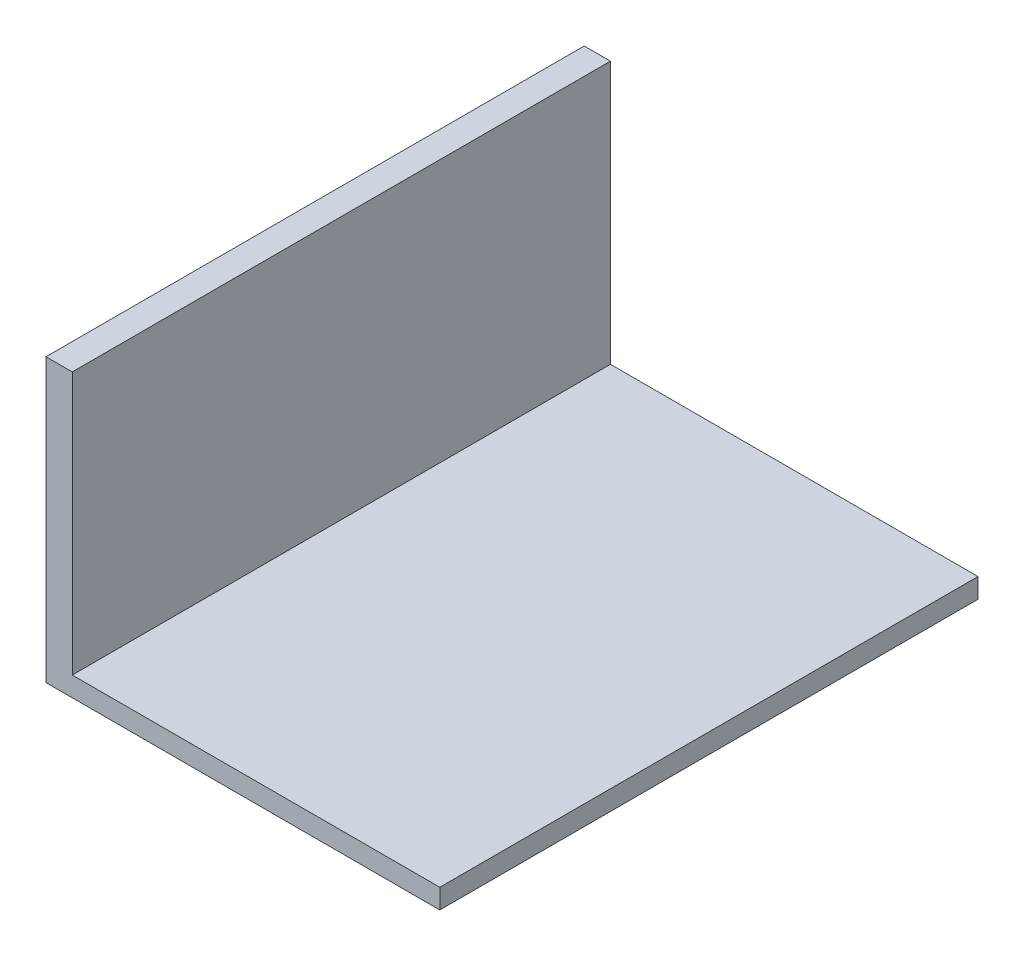
ISO-10303-21;
HEADER;
FILE_DESCRIPTION(('STEP AP214'),'2;1');
FILE_NAME('part.step','',(''),(''),'','','');
FILE_SCHEMA(('AUTOMOTIVE_DESIGN { 1 0 10303 214 1 1 1 1 }'));
ENDSEC;
DATA;
#1=APPLICATION_CONTEXT('core data for automotive mechanical design processes');
#2=APPLICATION_PROTOCOL_DEFINITION('international standard','automotive_design',2000,#1);
#3=PRODUCT_CONTEXT('',#1,'mechanical');
#4=PRODUCT('Part','Part','',(#3));
#5=PRODUCT_RELATED_PRODUCT_CATEGORY('part','',(#4));
#6=PRODUCT_DEFINITION_FORMATION('','',#4);
#7=PRODUCT_DEFINITION_CONTEXT('part definition',#1,'design');
#8=PRODUCT_DEFINITION('design','',#6,#7);
#9=PRODUCT_DEFINITION_SHAPE('','',#8);
#10=(LENGTH_UNIT() NAMED_UNIT(*) SI_UNIT(.MILLI.,.METRE.));
#11=(NAMED_UNIT(*) PLANE_ANGLE_UNIT() SI_UNIT($,.RADIAN.));
#12=(NAMED_UNIT(*) SI_UNIT($,.STERADIAN.) SOLID_ANGLE_UNIT());
#13=UNCERTAINTY_MEASURE_WITH_UNIT(LENGTH_MEASURE(1.E-05),#10,'distance_accuracy_value','');
#14=(GEOMETRIC_REPRESENTATION_CONTEXT(3) GLOBAL_UNCERTAINTY_ASSIGNED_CONTEXT((#13)) GLOBAL_UNIT_ASSIGNED_CONTEXT((#10,
#11,#12)) REPRESENTATION_CONTEXT('',''));
#15=CARTESIAN_POINT('',(0.,0.,0.));
#16=DIRECTION('',(0.,0.,1.));
#17=DIRECTION('',(1.,0.,0.));
#18=AXIS2_PLACEMENT_3D('',#15,#16,#17);
#19=CARTESIAN_POINT('',(0.,7.5,0.));
#20=DIRECTION('',(0.,-1.,0.));
#21=DIRECTION('',(0.,0.,-1.));
#22=AXIS2_PLACEMENT_3D('',#19,#20,#21);
#23=PLANE('',#22);
#24=DIRECTION('',(0.,0.,-1.));
#25=VECTOR('',#24,1.);
#26=CARTESIAN_POINT('',(-65.,7.5,-102.5));
#27=LINE('',#26,#25);
#28=CARTESIAN_POINT('',(-65.,7.5,102.5));
#29=VERTEX_POINT('',#28);
#30=CARTESIAN_POINT('',(-65.,7.5,-102.5));
#31=VERTEX_POINT('',#30);
#32=EDGE_CURVE('E55',#29,#31,#27,.T.);
#33=ORIENTED_EDGE('',*,*,#32,.F.);
#34=DIRECTION('',(1.,0.,0.));
#35=VECTOR('',#34,1.);
#36=CARTESIAN_POINT('',(-75.,7.5,102.5));
#37=LINE('',#36,#35);
#38=CARTESIAN_POINT('',(75.,7.5,102.5));
#39=VERTEX_POINT('',#38);
#40=EDGE_CURVE('E60',#29,#39,#37,.T.);
#41=ORIENTED_EDGE('',*,*,#40,.T.);
#42=DIRECTION('',(0.,0.,-1.));
#43=VECTOR('',#42,1.);
#44=CARTESIAN_POINT('',(75.,7.5,102.5));
#45=LINE('',#44,#43);
#46=CARTESIAN_POINT('',(75.,7.5,-102.5));
#47=VERTEX_POINT('',#46);
#48=EDGE_CURVE('E92',#39,#47,#45,.T.);
#49=ORIENTED_EDGE('',*,*,#48,.T.);
#50=DIRECTION('',(-1.,0.,0.));
#51=VECTOR('',#50,1.);
#52=CARTESIAN_POINT('',(-75.,7.5,-102.5));
#53=LINE('',#52,#51);
#54=EDGE_CURVE('E154',#47,#31,#53,.T.);
#55=ORIENTED_EDGE('',*,*,#54,.T.);
#56=EDGE_LOOP('',(#33,#41,#49,#55));
#57=FACE_BOUND('',#56,.T.);
#58=ADVANCED_FACE('F39',(#57),#23,.F.);
#59=CARTESIAN_POINT('',(75.,7.5,102.5));
#60=DIRECTION('',(-1.,0.,0.));
#61=DIRECTION('',(0.,0.,1.));
#62=AXIS2_PLACEMENT_3D('',#59,#60,#61);
#63=PLANE('',#62);
#64=DIRECTION('',(0.,0.,-1.));
#65=VECTOR('',#64,1.);
#66=CARTESIAN_POINT('',(75.,0.,102.5));
#67=LINE('',#66,#65);
#68=CARTESIAN_POINT('',(75.,0.,102.5));
#69=VERTEX_POINT('',#68);
#70=CARTESIAN_POINT('',(75.,0.,-102.5));
#71=VERTEX_POINT('',#70);
#72=EDGE_CURVE('E98',#69,#71,#67,.T.);
#73=ORIENTED_EDGE('',*,*,#72,.T.);
#74=DIRECTION('',(0.,-1.,0.));
#75=VECTOR('',#74,1.);
#76=CARTESIAN_POINT('',(75.,7.5,-102.5));
#77=LINE('',#76,#75);
#78=EDGE_CURVE('E11',#47,#71,#77,.T.);
#79=ORIENTED_EDGE('',*,*,#78,.F.);
#80=ORIENTED_EDGE('',*,*,#48,.F.);
#81=DIRECTION('',(0.,-1.,0.));
#82=VECTOR('',#81,1.);
#83=CARTESIAN_POINT('',(75.,7.5,102.5));
#84=LINE('',#83,#82);
#85=EDGE_CURVE('E83',#39,#69,#84,.T.);
#86=ORIENTED_EDGE('',*,*,#85,.T.);
#87=EDGE_LOOP('',(#73,#79,#80,#86));
#88=FACE_BOUND('',#87,.T.);
#89=ADVANCED_FACE('F41',(#88),#63,.F.);
#90=CARTESIAN_POINT('',(-75.,7.5,-102.5));
#91=DIRECTION('',(0.,0.,1.));
#92=DIRECTION('',(1.,0.,0.));
#93=AXIS2_PLACEMENT_3D('',#90,#91,#92);
#94=PLANE('',#93);
#95=DIRECTION('',(-1.,0.,0.));
#96=VECTOR('',#95,1.);
#97=CARTESIAN_POINT('',(-75.,0.,-102.5));
#98=LINE('',#97,#96);
#99=CARTESIAN_POINT('',(-75.,0.,-102.5));
#100=VERTEX_POINT('',#99);
#101=EDGE_CURVE('E102',#71,#100,#98,.T.);
#102=ORIENTED_EDGE('',*,*,#101,.T.);
#103=DIRECTION('',(0.,-1.,0.));
#104=VECTOR('',#103,1.);
#105=CARTESIAN_POINT('',(-75.,7.5,-102.5));
#106=LINE('',#105,#104);
#107=CARTESIAN_POINT('',(-75.,107.5,-102.5));
#108=VERTEX_POINT('',#107);
#109=EDGE_CURVE('E48',#108,#100,#106,.T.);
#110=ORIENTED_EDGE('',*,*,#109,.F.);
#111=DIRECTION('',(-1.,0.,0.));
#112=VECTOR('',#111,1.);
#113=CARTESIAN_POINT('',(-75.,107.5,-102.5));
#114=LINE('',#113,#112);
#115=CARTESIAN_POINT('',(-65.,107.5,-102.5));
#116=VERTEX_POINT('',#115);
#117=EDGE_CURVE('E132',#116,#108,#114,.T.);
#118=ORIENTED_EDGE('',*,*,#117,.F.);
#119=DIRECTION('',(0.,-1.,0.));
#120=VECTOR('',#119,1.);
#121=CARTESIAN_POINT('',(-65.,107.5,-102.5));
#122=LINE('',#121,#120);
#123=EDGE_CURVE('E110',#116,#31,#122,.T.);
#124=ORIENTED_EDGE('',*,*,#123,.T.);
#125=ORIENTED_EDGE('',*,*,#54,.F.);
#126=ORIENTED_EDGE('',*,*,#78,.T.);
#127=EDGE_LOOP('',(#102,#110,#118,#124,#125,#126));
#128=FACE_BOUND('',#127,.T.);
#129=ADVANCED_FACE('F129',(#128),#94,.F.);
#130=CARTESIAN_POINT('',(-75.,7.5,102.5));
#131=DIRECTION('',(1.,0.,0.));
#132=DIRECTION('',(0.,0.,-1.));
#133=AXIS2_PLACEMENT_3D('',#130,#131,#132);
#134=PLANE('',#133);
#135=DIRECTION('',(0.,0.,1.));
#136=VECTOR('',#135,1.);
#137=CARTESIAN_POINT('',(-75.,0.,102.5));
#138=LINE('',#137,#136);
#139=CARTESIAN_POINT('',(-75.,0.,102.5));
#140=VERTEX_POINT('',#139);
#141=EDGE_CURVE('E93',#100,#140,#138,.T.);
#142=ORIENTED_EDGE('',*,*,#141,.T.);
#143=DIRECTION('',(0.,-1.,0.));
#144=VECTOR('',#143,1.);
#145=CARTESIAN_POINT('',(-75.,7.5,102.5));
#146=LINE('',#145,#144);
#147=CARTESIAN_POINT('',(-75.,107.5,102.5));
#148=VERTEX_POINT('',#147);
#149=EDGE_CURVE('E87',#148,#140,#146,.T.);
#150=ORIENTED_EDGE('',*,*,#149,.F.);
#151=DIRECTION('',(0.,0.,1.));
#152=VECTOR('',#151,1.);
#153=CARTESIAN_POINT('',(-75.,107.5,-102.5));
#154=LINE('',#153,#152);
#155=EDGE_CURVE('E125',#108,#148,#154,.T.);
#156=ORIENTED_EDGE('',*,*,#155,.F.);
#157=ORIENTED_EDGE('',*,*,#109,.T.);
#158=EDGE_LOOP('',(#142,#150,#156,#157));
#159=FACE_BOUND('',#158,.T.);
#160=ADVANCED_FACE('F123',(#159),#134,.F.);
#161=CARTESIAN_POINT('',(-75.,7.5,102.5));
#162=DIRECTION('',(0.,0.,-1.));
#163=DIRECTION('',(-1.,0.,0.));
#164=AXIS2_PLACEMENT_3D('',#161,#162,#163);
#165=PLANE('',#164);
#166=DIRECTION('',(1.,0.,0.));
#167=VECTOR('',#166,1.);
#168=CARTESIAN_POINT('',(-75.,0.,102.5));
#169=LINE('',#168,#167);
#170=EDGE_CURVE('E80',#140,#69,#169,.T.);
#171=ORIENTED_EDGE('',*,*,#170,.T.);
#172=ORIENTED_EDGE('',*,*,#85,.F.);
#173=ORIENTED_EDGE('',*,*,#40,.F.);
#174=DIRECTION('',(0.,-1.,0.));
#175=VECTOR('',#174,1.);
#176=CARTESIAN_POINT('',(-65.,107.5,102.5));
#177=LINE('',#176,#175);
#178=CARTESIAN_POINT('',(-65.,107.5,102.5));
#179=VERTEX_POINT('',#178);
#180=EDGE_CURVE('E104',#179,#29,#177,.T.);
#181=ORIENTED_EDGE('',*,*,#180,.F.);
#182=DIRECTION('',(1.,0.,0.));
#183=VECTOR('',#182,1.);
#184=CARTESIAN_POINT('',(-75.,107.5,102.5));
#185=LINE('',#184,#183);
#186=EDGE_CURVE('E147',#148,#179,#185,.T.);
#187=ORIENTED_EDGE('',*,*,#186,.F.);
#188=ORIENTED_EDGE('',*,*,#149,.T.);
#189=EDGE_LOOP('',(#171,#172,#173,#181,#187,#188));
#190=FACE_BOUND('',#189,.T.);
#191=ADVANCED_FACE('F82',(#190),#165,.F.);
#192=CARTESIAN_POINT('',(0.,0.,0.));
#193=DIRECTION('',(0.,-1.,0.));
#194=DIRECTION('',(0.,0.,-1.));
#195=AXIS2_PLACEMENT_3D('',#192,#193,#194);
#196=PLANE('',#195);
#197=ORIENTED_EDGE('',*,*,#72,.F.);
#198=ORIENTED_EDGE('',*,*,#170,.F.);
#199=ORIENTED_EDGE('',*,*,#141,.F.);
#200=ORIENTED_EDGE('',*,*,#101,.F.);
#201=EDGE_LOOP('',(#197,#198,#199,#200));
#202=FACE_BOUND('',#201,.T.);
#203=ADVANCED_FACE('F101',(#202),#196,.T.);
#204=CARTESIAN_POINT('',(-65.,107.5,-102.5));
#205=DIRECTION('',(-1.,0.,0.));
#206=DIRECTION('',(0.,0.,1.));
#207=AXIS2_PLACEMENT_3D('',#204,#205,#206);
#208=PLANE('',#207);
#209=ORIENTED_EDGE('',*,*,#32,.T.);
#210=ORIENTED_EDGE('',*,*,#123,.F.);
#211=DIRECTION('',(0.,0.,-1.));
#212=VECTOR('',#211,1.);
#213=CARTESIAN_POINT('',(-65.,107.5,-102.5));
#214=LINE('',#213,#212);
#215=EDGE_CURVE('E140',#179,#116,#214,.T.);
#216=ORIENTED_EDGE('',*,*,#215,.F.);
#217=ORIENTED_EDGE('',*,*,#180,.T.);
#218=EDGE_LOOP('',(#209,#210,#216,#217));
#219=FACE_BOUND('',#218,.T.);
#220=ADVANCED_FACE('F159',(#219),#208,.F.);
#221=CARTESIAN_POINT('',(0.,107.5,0.));
#222=DIRECTION('',(0.,1.,0.));
#223=DIRECTION('',(0.,0.,1.));
#224=AXIS2_PLACEMENT_3D('',#221,#222,#223);
#225=PLANE('',#224);
#226=ORIENTED_EDGE('',*,*,#155,.T.);
#227=ORIENTED_EDGE('',*,*,#186,.T.);
#228=ORIENTED_EDGE('',*,*,#215,.T.);
#229=ORIENTED_EDGE('',*,*,#117,.T.);
#230=EDGE_LOOP('',(#226,#227,#228,#229));
#231=FACE_BOUND('',#230,.T.);
#232=ADVANCED_FACE('F136',(#231),#225,.T.);
#233=CLOSED_SHELL('',(#58,#89,#129,#160,#191,#203,#220,#232));
#234=MANIFOLD_SOLID_BREP('B2',#233);
#235=ADVANCED_BREP_SHAPE_REPRESENTATION('',(#18,#234),#14);
#236=SHAPE_DEFINITION_REPRESENTATION(#9,#235);
ENDSEC;
END-ISO-10303-21;
